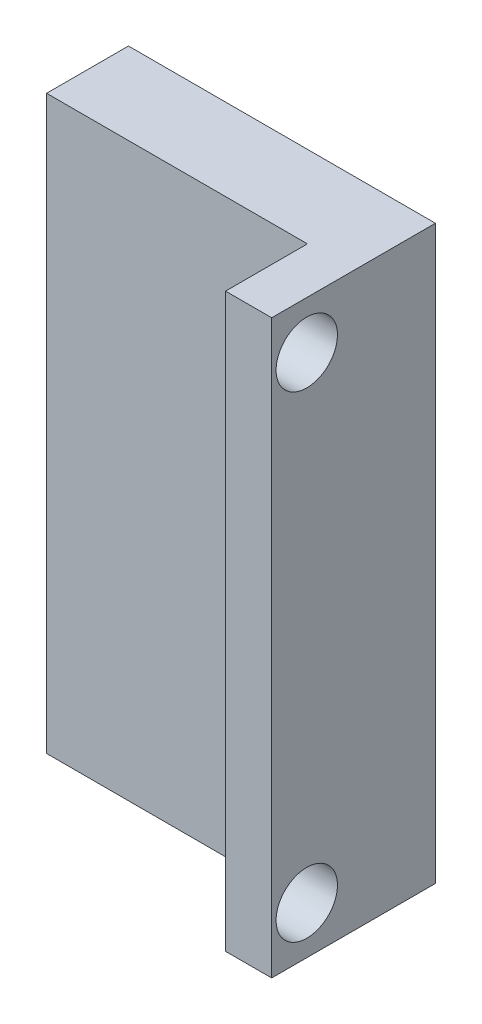
ISO-10303-21;
HEADER;
FILE_DESCRIPTION(('STEP AP214'),'2;1');
FILE_NAME('part.step','',(''),(''),'','','');
FILE_SCHEMA(('AUTOMOTIVE_DESIGN { 1 0 10303 214 1 1 1 1 }'));
ENDSEC;
DATA;
#1=APPLICATION_CONTEXT('core data for automotive mechanical design processes');
#2=APPLICATION_PROTOCOL_DEFINITION('international standard','automotive_design',2000,#1);
#3=PRODUCT_CONTEXT('',#1,'mechanical');
#4=PRODUCT('Part','Part','',(#3));
#5=PRODUCT_RELATED_PRODUCT_CATEGORY('part','',(#4));
#6=PRODUCT_DEFINITION_FORMATION('','',#4);
#7=PRODUCT_DEFINITION_CONTEXT('part definition',#1,'design');
#8=PRODUCT_DEFINITION('design','',#6,#7);
#9=PRODUCT_DEFINITION_SHAPE('','',#8);
#10=(LENGTH_UNIT() NAMED_UNIT(*) SI_UNIT(.MILLI.,.METRE.));
#11=(NAMED_UNIT(*) PLANE_ANGLE_UNIT() SI_UNIT($,.RADIAN.));
#12=(NAMED_UNIT(*) SI_UNIT($,.STERADIAN.) SOLID_ANGLE_UNIT());
#13=UNCERTAINTY_MEASURE_WITH_UNIT(LENGTH_MEASURE(1.E-05),#10,'distance_accuracy_value','');
#14=(GEOMETRIC_REPRESENTATION_CONTEXT(3) GLOBAL_UNCERTAINTY_ASSIGNED_CONTEXT((#13)) GLOBAL_UNIT_ASSIGNED_CONTEXT((#10,
#11,#12)) REPRESENTATION_CONTEXT('',''));
#15=CARTESIAN_POINT('',(0.,0.,0.));
#16=DIRECTION('',(0.,0.,1.));
#17=DIRECTION('',(1.,0.,0.));
#18=AXIS2_PLACEMENT_3D('',#15,#16,#17);
#19=CARTESIAN_POINT('',(0.,0.,158.8));
#20=DIRECTION('',(1.,0.,0.));
#21=DIRECTION('',(0.,0.,-1.));
#22=AXIS2_PLACEMENT_3D('',#19,#20,#21);
#23=PLANE('',#22);
#24=DIRECTION('',(0.,-1.,0.));
#25=VECTOR('',#24,1.);
#26=CARTESIAN_POINT('',(0.,18.97,158.8));
#27=LINE('',#26,#25);
#28=CARTESIAN_POINT('',(0.,18.97,158.8));
#29=VERTEX_POINT('',#28);
#30=CARTESIAN_POINT('',(0.,-8.97,158.8));
#31=VERTEX_POINT('',#30);
#32=EDGE_CURVE('E108',#29,#31,#27,.T.);
#33=ORIENTED_EDGE('',*,*,#32,.T.);
#34=DIRECTION('',(0.,0.,-1.));
#35=VECTOR('',#34,1.);
#36=CARTESIAN_POINT('',(0.,-8.97,162.8));
#37=LINE('',#36,#35);
#38=CARTESIAN_POINT('',(0.,-8.97,162.8));
#39=VERTEX_POINT('',#38);
#40=EDGE_CURVE('E48',#39,#31,#37,.T.);
#41=ORIENTED_EDGE('',*,*,#40,.F.);
#42=DIRECTION('',(0.,-1.,0.));
#43=VECTOR('',#42,1.);
#44=CARTESIAN_POINT('',(0.,18.97,162.8));
#45=LINE('',#44,#43);
#46=CARTESIAN_POINT('',(0.,18.97,162.8));
#47=VERTEX_POINT('',#46);
#48=EDGE_CURVE('E61',#47,#39,#45,.T.);
#49=ORIENTED_EDGE('',*,*,#48,.F.);
#50=DIRECTION('',(0.,0.,-1.));
#51=VECTOR('',#50,1.);
#52=CARTESIAN_POINT('',(0.,18.97,162.8));
#53=LINE('',#52,#51);
#54=EDGE_CURVE('E11',#47,#29,#53,.T.);
#55=ORIENTED_EDGE('',*,*,#54,.T.);
#56=EDGE_LOOP('',(#33,#41,#49,#55));
#57=FACE_BOUND('',#56,.T.);
#58=ADVANCED_FACE('F41',(#57),#23,.F.);
#59=CARTESIAN_POINT('',(0.,0.,158.8));
#60=DIRECTION('',(0.,0.,1.));
#61=DIRECTION('',(1.,0.,0.));
#62=AXIS2_PLACEMENT_3D('',#59,#60,#61);
#63=PLANE('',#62);
#64=DIRECTION('',(1.,0.,0.));
#65=VECTOR('',#64,1.);
#66=CARTESIAN_POINT('',(0.,-8.97,158.8));
#67=LINE('',#66,#65);
#68=CARTESIAN_POINT('',(15.,-8.97,158.8));
#69=VERTEX_POINT('',#68);
#70=EDGE_CURVE('E94',#31,#69,#67,.T.);
#71=ORIENTED_EDGE('',*,*,#70,.F.);
#72=ORIENTED_EDGE('',*,*,#32,.F.);
#73=DIRECTION('',(-1.,0.,0.));
#74=VECTOR('',#73,1.);
#75=CARTESIAN_POINT('',(15.,18.97,158.8));
#76=LINE('',#75,#74);
#77=CARTESIAN_POINT('',(15.,18.97,158.8));
#78=VERTEX_POINT('',#77);
#79=EDGE_CURVE('E100',#78,#29,#76,.T.);
#80=ORIENTED_EDGE('',*,*,#79,.F.);
#81=DIRECTION('',(0.,1.,0.));
#82=VECTOR('',#81,1.);
#83=CARTESIAN_POINT('',(15.,-8.97,158.8));
#84=LINE('',#83,#82);
#85=EDGE_CURVE('E81',#69,#78,#84,.T.);
#86=ORIENTED_EDGE('',*,*,#85,.F.);
#87=EDGE_LOOP('',(#71,#72,#80,#86));
#88=FACE_BOUND('',#87,.T.);
#89=ADVANCED_FACE('F107',(#88),#63,.F.);
#90=CARTESIAN_POINT('',(15.,18.97,162.8));
#91=DIRECTION('',(0.,-1.,0.));
#92=DIRECTION('',(0.,0.,-1.));
#93=AXIS2_PLACEMENT_3D('',#90,#91,#92);
#94=PLANE('',#93);
#95=ORIENTED_EDGE('',*,*,#79,.T.);
#96=ORIENTED_EDGE('',*,*,#54,.F.);
#97=DIRECTION('',(-1.,0.,0.));
#98=VECTOR('',#97,1.);
#99=CARTESIAN_POINT('',(15.,18.97,162.8));
#100=LINE('',#99,#98);
#101=CARTESIAN_POINT('',(12.7455153503555,18.97,162.8));
#102=VERTEX_POINT('',#101);
#103=EDGE_CURVE('E93',#102,#47,#100,.T.);
#104=ORIENTED_EDGE('',*,*,#103,.F.);
#105=DIRECTION('',(0.,0.,-1.));
#106=VECTOR('',#105,1.);
#107=CARTESIAN_POINT('',(12.7455153503555,18.97,166.8));
#108=LINE('',#107,#106);
#109=CARTESIAN_POINT('',(12.7455153503555,18.97,166.8));
#110=VERTEX_POINT('',#109);
#111=EDGE_CURVE('E109',#110,#102,#108,.T.);
#112=ORIENTED_EDGE('',*,*,#111,.F.);
#113=DIRECTION('',(-1.,0.,0.));
#114=VECTOR('',#113,1.);
#115=CARTESIAN_POINT('',(15.,18.97,166.8));
#116=LINE('',#115,#114);
#117=CARTESIAN_POINT('',(15.,18.97,166.8));
#118=VERTEX_POINT('',#117);
#119=EDGE_CURVE('E103',#118,#110,#116,.T.);
#120=ORIENTED_EDGE('',*,*,#119,.F.);
#121=DIRECTION('',(0.,0.,-1.));
#122=VECTOR('',#121,1.);
#123=CARTESIAN_POINT('',(15.,18.97,162.8));
#124=LINE('',#123,#122);
#125=EDGE_CURVE('E86',#118,#78,#124,.T.);
#126=ORIENTED_EDGE('',*,*,#125,.T.);
#127=EDGE_LOOP('',(#95,#96,#104,#112,#120,#126));
#128=FACE_BOUND('',#127,.T.);
#129=ADVANCED_FACE('F98',(#128),#94,.F.);
#130=CARTESIAN_POINT('',(0.,-8.97,162.8));
#131=DIRECTION('',(0.,1.,0.));
#132=DIRECTION('',(0.,0.,1.));
#133=AXIS2_PLACEMENT_3D('',#130,#131,#132);
#134=PLANE('',#133);
#135=ORIENTED_EDGE('',*,*,#70,.T.);
#136=DIRECTION('',(0.,0.,-1.));
#137=VECTOR('',#136,1.);
#138=CARTESIAN_POINT('',(15.,-8.97,162.8));
#139=LINE('',#138,#137);
#140=CARTESIAN_POINT('',(15.,-8.97,166.8));
#141=VERTEX_POINT('',#140);
#142=EDGE_CURVE('E89',#141,#69,#139,.T.);
#143=ORIENTED_EDGE('',*,*,#142,.F.);
#144=DIRECTION('',(1.,0.,0.));
#145=VECTOR('',#144,1.);
#146=CARTESIAN_POINT('',(15.,-8.97,166.8));
#147=LINE('',#146,#145);
#148=CARTESIAN_POINT('',(12.7455153503555,-8.97,166.8));
#149=VERTEX_POINT('',#148);
#150=EDGE_CURVE('E139',#149,#141,#147,.T.);
#151=ORIENTED_EDGE('',*,*,#150,.F.);
#152=DIRECTION('',(0.,0.,-1.));
#153=VECTOR('',#152,1.);
#154=CARTESIAN_POINT('',(12.7455153503555,-8.97,166.8));
#155=LINE('',#154,#153);
#156=CARTESIAN_POINT('',(12.7455153503555,-8.97,162.8));
#157=VERTEX_POINT('',#156);
#158=EDGE_CURVE('E113',#149,#157,#155,.T.);
#159=ORIENTED_EDGE('',*,*,#158,.T.);
#160=DIRECTION('',(1.,0.,0.));
#161=VECTOR('',#160,1.);
#162=CARTESIAN_POINT('',(0.,-8.97,162.8));
#163=LINE('',#162,#161);
#164=EDGE_CURVE('E105',#39,#157,#163,.T.);
#165=ORIENTED_EDGE('',*,*,#164,.F.);
#166=ORIENTED_EDGE('',*,*,#40,.T.);
#167=EDGE_LOOP('',(#135,#143,#151,#159,#165,#166));
#168=FACE_BOUND('',#167,.T.);
#169=ADVANCED_FACE('F122',(#168),#134,.F.);
#170=CARTESIAN_POINT('',(15.,-8.97,162.8));
#171=DIRECTION('',(-1.,0.,0.));
#172=DIRECTION('',(0.,0.,1.));
#173=AXIS2_PLACEMENT_3D('',#170,#171,#172);
#174=PLANE('',#173);
#175=CARTESIAN_POINT('',(15.,16.64426,165.086));
#176=DIRECTION('',(-1.,0.,0.));
#177=DIRECTION('',(0.,0.,1.));
#178=AXIS2_PLACEMENT_3D('',#175,#176,#177);
#179=CIRCLE('',#178,1.5);
#180=CARTESIAN_POINT('',(15.,16.64426,166.586));
#181=VERTEX_POINT('',#180);
#182=EDGE_CURVE('E147',#181,#181,#179,.T.);
#183=ORIENTED_EDGE('',*,*,#182,.T.);
#184=EDGE_LOOP('',(#183));
#185=FACE_BOUND('',#184,.T.);
#186=CARTESIAN_POINT('',(15.,-6.645,165.086));
#187=DIRECTION('',(-1.,0.,0.));
#188=DIRECTION('',(0.,0.,1.));
#189=AXIS2_PLACEMENT_3D('',#186,#187,#188);
#190=CIRCLE('',#189,1.5);
#191=CARTESIAN_POINT('',(15.,-6.645,166.586));
#192=VERTEX_POINT('',#191);
#193=EDGE_CURVE('E156',#192,#192,#190,.T.);
#194=ORIENTED_EDGE('',*,*,#193,.T.);
#195=EDGE_LOOP('',(#194));
#196=FACE_BOUND('',#195,.T.);
#197=ORIENTED_EDGE('',*,*,#85,.T.);
#198=ORIENTED_EDGE('',*,*,#125,.F.);
#199=DIRECTION('',(0.,1.,0.));
#200=VECTOR('',#199,1.);
#201=CARTESIAN_POINT('',(15.,18.97,166.8));
#202=LINE('',#201,#200);
#203=EDGE_CURVE('E142',#141,#118,#202,.T.);
#204=ORIENTED_EDGE('',*,*,#203,.F.);
#205=ORIENTED_EDGE('',*,*,#142,.T.);
#206=EDGE_LOOP('',(#197,#198,#204,#205));
#207=FACE_BOUND('',#206,.T.);
#208=ADVANCED_FACE('F83',(#185,#196,#207),#174,.F.);
#209=CARTESIAN_POINT('',(0.,0.,162.8));
#210=DIRECTION('',(0.,0.,1.));
#211=DIRECTION('',(1.,0.,0.));
#212=AXIS2_PLACEMENT_3D('',#209,#210,#211);
#213=PLANE('',#212);
#214=DIRECTION('',(0.,-1.,0.));
#215=VECTOR('',#214,1.);
#216=CARTESIAN_POINT('',(12.7455153503555,18.97,162.8));
#217=LINE('',#216,#215);
#218=EDGE_CURVE('E55',#102,#157,#217,.T.);
#219=ORIENTED_EDGE('',*,*,#218,.F.);
#220=ORIENTED_EDGE('',*,*,#103,.T.);
#221=ORIENTED_EDGE('',*,*,#48,.T.);
#222=ORIENTED_EDGE('',*,*,#164,.T.);
#223=EDGE_LOOP('',(#219,#220,#221,#222));
#224=FACE_BOUND('',#223,.T.);
#225=ADVANCED_FACE('F148',(#224),#213,.T.);
#226=CARTESIAN_POINT('',(12.7455153503555,18.97,166.8));
#227=DIRECTION('',(1.,0.,0.));
#228=DIRECTION('',(0.,0.,-1.));
#229=AXIS2_PLACEMENT_3D('',#226,#227,#228);
#230=PLANE('',#229);
#231=CARTESIAN_POINT('',(12.7455153503555,16.64426,165.086));
#232=DIRECTION('',(-1.,0.,0.));
#233=DIRECTION('',(0.,0.,1.));
#234=AXIS2_PLACEMENT_3D('',#231,#232,#233);
#235=CIRCLE('',#234,1.5);
#236=CARTESIAN_POINT('',(12.7455153503555,16.64426,166.586));
#237=VERTEX_POINT('',#236);
#238=EDGE_CURVE('E159',#237,#237,#235,.T.);
#239=ORIENTED_EDGE('',*,*,#238,.F.);
#240=EDGE_LOOP('',(#239));
#241=FACE_BOUND('',#240,.T.);
#242=CARTESIAN_POINT('',(12.7455153503555,-6.645,165.086));
#243=DIRECTION('',(-1.,0.,0.));
#244=DIRECTION('',(0.,0.,1.));
#245=AXIS2_PLACEMENT_3D('',#242,#243,#244);
#246=CIRCLE('',#245,1.5);
#247=CARTESIAN_POINT('',(12.7455153503555,-6.645,166.586));
#248=VERTEX_POINT('',#247);
#249=EDGE_CURVE('E160',#248,#248,#246,.T.);
#250=ORIENTED_EDGE('',*,*,#249,.F.);
#251=EDGE_LOOP('',(#250));
#252=FACE_BOUND('',#251,.T.);
#253=ORIENTED_EDGE('',*,*,#218,.T.);
#254=ORIENTED_EDGE('',*,*,#158,.F.);
#255=DIRECTION('',(0.,-1.,0.));
#256=VECTOR('',#255,1.);
#257=CARTESIAN_POINT('',(12.7455153503555,18.97,166.8));
#258=LINE('',#257,#256);
#259=EDGE_CURVE('E133',#110,#149,#258,.T.);
#260=ORIENTED_EDGE('',*,*,#259,.F.);
#261=ORIENTED_EDGE('',*,*,#111,.T.);
#262=EDGE_LOOP('',(#253,#254,#260,#261));
#263=FACE_BOUND('',#262,.T.);
#264=ADVANCED_FACE('F129',(#241,#252,#263),#230,.F.);
#265=CARTESIAN_POINT('',(0.,0.,166.8));
#266=DIRECTION('',(0.,0.,-1.));
#267=DIRECTION('',(-1.,0.,0.));
#268=AXIS2_PLACEMENT_3D('',#265,#266,#267);
#269=PLANE('',#268);
#270=ORIENTED_EDGE('',*,*,#203,.T.);
#271=ORIENTED_EDGE('',*,*,#119,.T.);
#272=ORIENTED_EDGE('',*,*,#259,.T.);
#273=ORIENTED_EDGE('',*,*,#150,.T.);
#274=EDGE_LOOP('',(#270,#271,#272,#273));
#275=FACE_BOUND('',#274,.T.);
#276=ADVANCED_FACE('F152',(#275),#269,.F.);
#277=CARTESIAN_POINT('',(52.7455153503555,-6.645,165.086));
#278=DIRECTION('',(-1.,0.,0.));
#279=DIRECTION('',(0.,0.,1.));
#280=AXIS2_PLACEMENT_3D('',#277,#278,#279);
#281=CYLINDRICAL_SURFACE('',#280,1.5);
#282=ORIENTED_EDGE('',*,*,#249,.T.);
#283=EDGE_LOOP('',(#282));
#284=FACE_BOUND('',#283,.T.);
#285=ORIENTED_EDGE('',*,*,#193,.F.);
#286=EDGE_LOOP('',(#285));
#287=FACE_BOUND('',#286,.T.);
#288=ADVANCED_FACE('F174',(#284,#287),#281,.F.);
#289=CARTESIAN_POINT('',(52.7455153503555,16.64426,165.086));
#290=DIRECTION('',(-1.,0.,0.));
#291=DIRECTION('',(0.,0.,1.));
#292=AXIS2_PLACEMENT_3D('',#289,#290,#291);
#293=CYLINDRICAL_SURFACE('',#292,1.5);
#294=ORIENTED_EDGE('',*,*,#238,.T.);
#295=EDGE_LOOP('',(#294));
#296=FACE_BOUND('',#295,.T.);
#297=ORIENTED_EDGE('',*,*,#182,.F.);
#298=EDGE_LOOP('',(#297));
#299=FACE_BOUND('',#298,.T.);
#300=ADVANCED_FACE('F166',(#296,#299),#293,.F.);
#301=CLOSED_SHELL('',(#58,#89,#129,#169,#208,#225,#264,#276,#288,#300));
#302=MANIFOLD_SOLID_BREP('B2',#301);
#303=ADVANCED_BREP_SHAPE_REPRESENTATION('',(#18,#302),#14);
#304=SHAPE_DEFINITION_REPRESENTATION(#9,#303);
ENDSEC;
END-ISO-10303-21;
